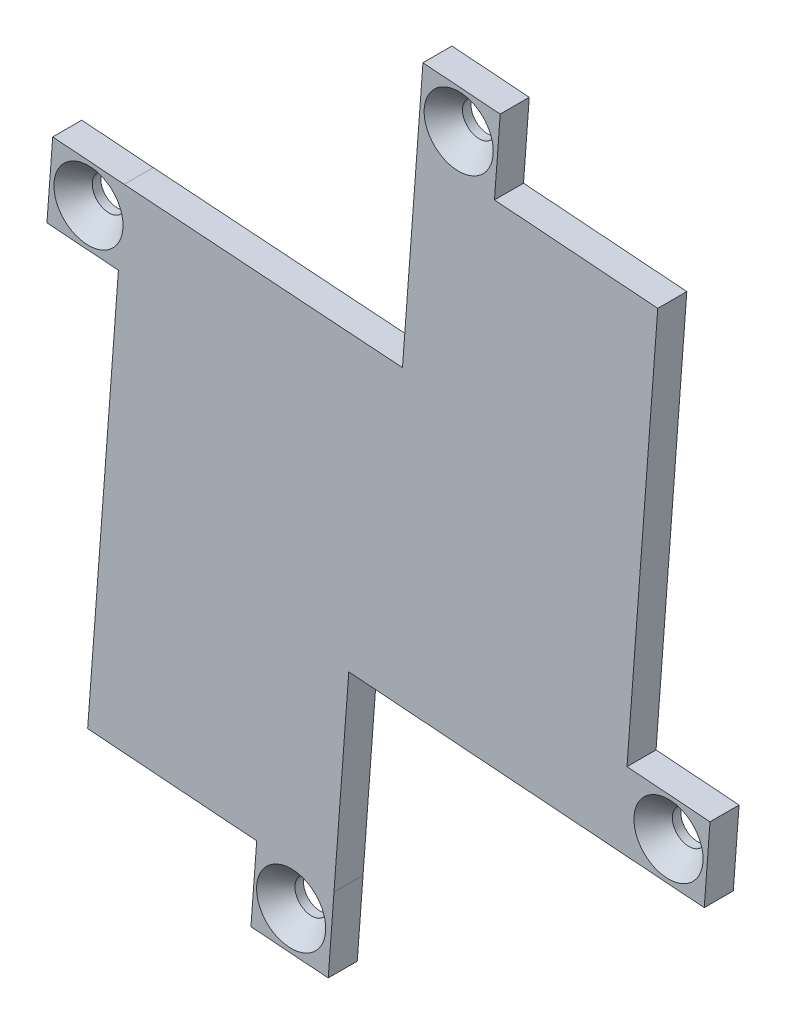
ISO-10303-21;
HEADER;
FILE_DESCRIPTION(('STEP AP214'),'2;1');
FILE_NAME('part.step','',(''),(''),'','','');
FILE_SCHEMA(('AUTOMOTIVE_DESIGN { 1 0 10303 214 1 1 1 1 }'));
ENDSEC;
DATA;
#1=APPLICATION_CONTEXT('core data for automotive mechanical design processes');
#2=APPLICATION_PROTOCOL_DEFINITION('international standard','automotive_design',2000,#1);
#3=PRODUCT_CONTEXT('',#1,'mechanical');
#4=PRODUCT('Part','Part','',(#3));
#5=PRODUCT_RELATED_PRODUCT_CATEGORY('part','',(#4));
#6=PRODUCT_DEFINITION_FORMATION('','',#4);
#7=PRODUCT_DEFINITION_CONTEXT('part definition',#1,'design');
#8=PRODUCT_DEFINITION('design','',#6,#7);
#9=PRODUCT_DEFINITION_SHAPE('','',#8);
#10=(LENGTH_UNIT() NAMED_UNIT(*) SI_UNIT(.MILLI.,.METRE.));
#11=(NAMED_UNIT(*) PLANE_ANGLE_UNIT() SI_UNIT($,.RADIAN.));
#12=(NAMED_UNIT(*) SI_UNIT($,.STERADIAN.) SOLID_ANGLE_UNIT());
#13=UNCERTAINTY_MEASURE_WITH_UNIT(LENGTH_MEASURE(1.E-05),#10,'distance_accuracy_value','');
#14=(GEOMETRIC_REPRESENTATION_CONTEXT(3) GLOBAL_UNCERTAINTY_ASSIGNED_CONTEXT((#13)) GLOBAL_UNIT_ASSIGNED_CONTEXT((#10,
#11,#12)) REPRESENTATION_CONTEXT('',''));
#15=CARTESIAN_POINT('',(0.,0.,0.));
#16=DIRECTION('',(0.,0.,1.));
#17=DIRECTION('',(1.,0.,0.));
#18=AXIS2_PLACEMENT_3D('',#15,#16,#17);
#19=CARTESIAN_POINT('',(-1.11849366012123,-14.9906316009668,3.));
#20=DIRECTION('',(-0.0744060196512933,-0.997228030211572,0.));
#21=DIRECTION('',(0.997228030211572,-0.0744060196512933,0.));
#22=AXIS2_PLACEMENT_3D('',#19,#20,#21);
#23=PLANE('',#22);
#24=DIRECTION('',(-0.997228030211572,0.0744060196512933,0.));
#25=VECTOR('',#24,1.);
#26=CARTESIAN_POINT('',(-1.11849366012123,-14.9906316009668,0.));
#27=LINE('',#26,#25);
#28=CARTESIAN_POINT('',(34.6728480546199,-17.6611254040824,0.));
#29=VERTEX_POINT('',#28);
#30=CARTESIAN_POINT('',(-2.02528865101463,-14.9229730475888,0.));
#31=VERTEX_POINT('',#30);
#32=EDGE_CURVE('E196',#29,#31,#27,.T.);
#33=ORIENTED_EDGE('',*,*,#32,.F.);
#34=DIRECTION('',(0.,0.,-1.));
#35=VECTOR('',#34,1.);
#36=CARTESIAN_POINT('',(34.6728480546199,-17.6611254040824,3.));
#37=LINE('',#36,#35);
#38=CARTESIAN_POINT('',(34.6728480546199,-17.6611254040824,3.));
#39=VERTEX_POINT('',#38);
#40=EDGE_CURVE('E11',#39,#29,#37,.T.);
#41=ORIENTED_EDGE('',*,*,#40,.F.);
#42=DIRECTION('',(-0.997228030211572,0.0744060196512933,0.));
#43=VECTOR('',#42,1.);
#44=CARTESIAN_POINT('',(-1.11849366012123,-14.9906316009668,3.));
#45=LINE('',#44,#43);
#46=CARTESIAN_POINT('',(-2.02528865101463,-14.9229730475888,3.));
#47=VERTEX_POINT('',#46);
#48=EDGE_CURVE('E238',#39,#47,#45,.T.);
#49=ORIENTED_EDGE('',*,*,#48,.T.);
#50=DIRECTION('',(0.,0.,-1.));
#51=VECTOR('',#50,1.);
#52=CARTESIAN_POINT('',(-2.02528865101463,-14.9229730475888,3.));
#53=LINE('',#52,#51);
#54=EDGE_CURVE('E121',#47,#31,#53,.T.);
#55=ORIENTED_EDGE('',*,*,#54,.T.);
#56=EDGE_LOOP('',(#33,#41,#49,#55));
#57=FACE_BOUND('',#56,.T.);
#58=ADVANCED_FACE('F37',(#57),#23,.T.);
#59=CARTESIAN_POINT('',(35.7913669216806,-2.67056932096597,3.));
#60=DIRECTION('',(-0.997227877974212,0.074408059987134,0.));
#61=DIRECTION('',(-0.074408059987134,-0.997227877974213,0.));
#62=AXIS2_PLACEMENT_3D('',#59,#60,#61);
#63=PLANE('',#62);
#64=DIRECTION('',(0.074408059987134,0.997227877974213,0.));
#65=VECTOR('',#64,1.);
#66=CARTESIAN_POINT('',(35.7913669216806,-2.67056932096597,0.));
#67=LINE('',#66,#65);
#68=CARTESIAN_POINT('',(35.268112443172,-9.6833036045072,0.));
#69=VERTEX_POINT('',#68);
#70=EDGE_CURVE('E199',#29,#69,#67,.T.);
#71=ORIENTED_EDGE('',*,*,#70,.T.);
#72=DIRECTION('',(0.,0.,-1.));
#73=VECTOR('',#72,1.);
#74=CARTESIAN_POINT('',(35.268112443172,-9.6833036045072,3.));
#75=LINE('',#74,#73);
#76=CARTESIAN_POINT('',(35.268112443172,-9.6833036045072,3.));
#77=VERTEX_POINT('',#76);
#78=EDGE_CURVE('E45',#77,#69,#75,.T.);
#79=ORIENTED_EDGE('',*,*,#78,.F.);
#80=DIRECTION('',(0.074408059987134,0.997227877974213,0.));
#81=VECTOR('',#80,1.);
#82=CARTESIAN_POINT('',(35.7913669216806,-2.67056932096597,3.));
#83=LINE('',#82,#81);
#84=EDGE_CURVE('E338',#39,#77,#83,.T.);
#85=ORIENTED_EDGE('',*,*,#84,.F.);
#86=ORIENTED_EDGE('',*,*,#40,.T.);
#87=EDGE_LOOP('',(#71,#79,#85,#86));
#88=FACE_BOUND('',#87,.T.);
#89=ADVANCED_FACE('F343',(#88),#63,.F.);
#90=CARTESIAN_POINT('',(-0.523254478508531,-7.01273428354124,3.));
#91=DIRECTION('',(-0.0744080599871337,-0.997227877974212,0.));
#92=DIRECTION('',(0.997227877974213,-0.0744080599871337,0.));
#93=AXIS2_PLACEMENT_3D('',#90,#91,#92);
#94=PLANE('',#93);
#95=DIRECTION('',(-0.997227877974213,0.0744080599871337,0.));
#96=VECTOR('',#95,1.);
#97=CARTESIAN_POINT('',(-0.523254478508531,-7.01273428354124,0.));
#98=LINE('',#97,#96);
#99=CARTESIAN_POINT('',(26.6973524890665,-9.04379719390032,0.));
#100=VERTEX_POINT('',#99);
#101=EDGE_CURVE('E202',#69,#100,#98,.T.);
#102=ORIENTED_EDGE('',*,*,#101,.T.);
#103=DIRECTION('',(0.,0.,-1.));
#104=VECTOR('',#103,1.);
#105=CARTESIAN_POINT('',(26.6973524890665,-9.04379719390032,3.));
#106=LINE('',#105,#104);
#107=CARTESIAN_POINT('',(26.6973524890665,-9.04379719390032,3.));
#108=VERTEX_POINT('',#107);
#109=EDGE_CURVE('E272',#108,#100,#106,.T.);
#110=ORIENTED_EDGE('',*,*,#109,.F.);
#111=DIRECTION('',(-0.997227877974213,0.0744080599871337,0.));
#112=VECTOR('',#111,1.);
#113=CARTESIAN_POINT('',(-0.523254478508531,-7.01273428354124,3.));
#114=LINE('',#113,#112);
#115=EDGE_CURVE('E281',#77,#108,#114,.T.);
#116=ORIENTED_EDGE('',*,*,#115,.F.);
#117=ORIENTED_EDGE('',*,*,#78,.T.);
#118=EDGE_LOOP('',(#102,#110,#116,#117));
#119=FACE_BOUND('',#118,.T.);
#120=ADVANCED_FACE('F279',(#119),#94,.F.);
#121=CARTESIAN_POINT('',(27.2206069675751,-2.03106291035925,3.));
#122=DIRECTION('',(-0.997227877974212,0.0744080599871397,0.));
#123=DIRECTION('',(-0.0744080599871397,-0.997227877974212,0.));
#124=AXIS2_PLACEMENT_3D('',#121,#122,#123);
#125=PLANE('',#124);
#126=DIRECTION('',(0.0744080599871397,0.997227877974212,0.));
#127=VECTOR('',#126,1.);
#128=CARTESIAN_POINT('',(27.2206069675751,-2.03106291035925,0.));
#129=LINE('',#128,#127);
#130=CARTESIAN_POINT('',(29.8736465497676,33.525367847124,0.));
#131=VERTEX_POINT('',#130);
#132=EDGE_CURVE('E204',#100,#131,#129,.T.);
#133=ORIENTED_EDGE('',*,*,#132,.T.);
#134=DIRECTION('',(0.,0.,-1.));
#135=VECTOR('',#134,1.);
#136=CARTESIAN_POINT('',(29.8736465497676,33.525367847124,3.));
#137=LINE('',#136,#135);
#138=CARTESIAN_POINT('',(29.8736465497676,33.525367847124,3.));
#139=VERTEX_POINT('',#138);
#140=EDGE_CURVE('E269',#139,#131,#137,.T.);
#141=ORIENTED_EDGE('',*,*,#140,.F.);
#142=DIRECTION('',(0.0744080599871397,0.997227877974212,0.));
#143=VECTOR('',#142,1.);
#144=CARTESIAN_POINT('',(27.2206069675751,-2.03106291035925,3.));
#145=LINE('',#144,#143);
#146=EDGE_CURVE('E300',#108,#139,#145,.T.);
#147=ORIENTED_EDGE('',*,*,#146,.F.);
#148=ORIENTED_EDGE('',*,*,#109,.T.);
#149=EDGE_LOOP('',(#133,#141,#147,#148));
#150=FACE_BOUND('',#149,.T.);
#151=ADVANCED_FACE('F291',(#150),#125,.F.);
#152=CARTESIAN_POINT('',(2.65303958219247,35.5564307574832,3.));
#153=DIRECTION('',(-0.0744080599871398,-0.997227877974212,0.));
#154=DIRECTION('',(0.997227877974212,-0.0744080599871398,0.));
#155=AXIS2_PLACEMENT_3D('',#152,#153,#154);
#156=PLANE('',#155);
#157=DIRECTION('',(-0.997227877974212,0.0744080599871398,0.));
#158=VECTOR('',#157,1.);
#159=CARTESIAN_POINT('',(2.65303958219247,35.5564307574832,0.));
#160=LINE('',#159,#158);
#161=CARTESIAN_POINT('',(13.0149922740122,34.7832746770063,0.));
#162=VERTEX_POINT('',#161);
#163=EDGE_CURVE('E206',#131,#162,#160,.T.);
#164=ORIENTED_EDGE('',*,*,#163,.T.);
#165=DIRECTION('',(0.,0.,-1.));
#166=VECTOR('',#165,1.);
#167=CARTESIAN_POINT('',(13.0149922740122,34.7832746770063,3.));
#168=LINE('',#167,#166);
#169=CARTESIAN_POINT('',(13.0149922740122,34.7832746770063,3.));
#170=VERTEX_POINT('',#169);
#171=EDGE_CURVE('E266',#170,#162,#168,.T.);
#172=ORIENTED_EDGE('',*,*,#171,.F.);
#173=DIRECTION('',(-0.997227877974212,0.0744080599871398,0.));
#174=VECTOR('',#173,1.);
#175=CARTESIAN_POINT('',(2.65303958219247,35.5564307574832,3.));
#176=LINE('',#175,#174);
#177=EDGE_CURVE('E297',#139,#170,#176,.T.);
#178=ORIENTED_EDGE('',*,*,#177,.F.);
#179=ORIENTED_EDGE('',*,*,#140,.T.);
#180=EDGE_LOOP('',(#164,#172,#178,#179));
#181=FACE_BOUND('',#180,.T.);
#182=ADVANCED_FACE('F295',(#181),#156,.F.);
#183=CARTESIAN_POINT('',(10.3619526918197,-0.773156080476891,3.));
#184=DIRECTION('',(-0.997227877974212,0.0744080599871399,0.));
#185=DIRECTION('',(-0.0744080599871399,-0.997227877974212,0.));
#186=AXIS2_PLACEMENT_3D('',#183,#184,#185);
#187=PLANE('',#186);
#188=DIRECTION('',(0.0744080599871399,0.997227877974212,0.));
#189=VECTOR('',#188,1.);
#190=CARTESIAN_POINT('',(10.3619526918197,-0.773156080476891,0.));
#191=LINE('',#190,#189);
#192=CARTESIAN_POINT('',(13.6102567539093,42.7610977008,0.));
#193=VERTEX_POINT('',#192);
#194=EDGE_CURVE('E208',#162,#193,#191,.T.);
#195=ORIENTED_EDGE('',*,*,#194,.T.);
#196=DIRECTION('',(0.,0.,-1.));
#197=VECTOR('',#196,1.);
#198=CARTESIAN_POINT('',(13.6102567539093,42.7610977008,3.));
#199=LINE('',#198,#197);
#200=CARTESIAN_POINT('',(13.6102567539093,42.7610977008,3.));
#201=VERTEX_POINT('',#200);
#202=EDGE_CURVE('E263',#201,#193,#199,.T.);
#203=ORIENTED_EDGE('',*,*,#202,.F.);
#204=DIRECTION('',(0.0744080599871399,0.997227877974212,0.));
#205=VECTOR('',#204,1.);
#206=CARTESIAN_POINT('',(10.3619526918197,-0.773156080476891,3.));
#207=LINE('',#206,#205);
#208=EDGE_CURVE('E299',#170,#201,#207,.T.);
#209=ORIENTED_EDGE('',*,*,#208,.F.);
#210=ORIENTED_EDGE('',*,*,#171,.T.);
#211=EDGE_LOOP('',(#195,#203,#209,#210));
#212=FACE_BOUND('',#211,.T.);
#213=ADVANCED_FACE('F355',(#212),#187,.F.);
#214=CARTESIAN_POINT('',(3.2483040620896,43.5342537812769,3.));
#215=DIRECTION('',(-0.07440805998714,-0.997227877974212,0.));
#216=DIRECTION('',(0.997227877974212,-0.07440805998714,0.));
#217=AXIS2_PLACEMENT_3D('',#214,#215,#216);
#218=PLANE('',#217);
#219=DIRECTION('',(-0.997227877974212,0.07440805998714,0.));
#220=VECTOR('',#219,1.);
#221=CARTESIAN_POINT('',(3.2483040620896,43.5342537812769,0.));
#222=LINE('',#221,#220);
#223=CARTESIAN_POINT('',(5.63243373011565,43.3563621806971,0.));
#224=VERTEX_POINT('',#223);
#225=EDGE_CURVE('E210',#193,#224,#222,.T.);
#226=ORIENTED_EDGE('',*,*,#225,.T.);
#227=DIRECTION('',(0.,0.,-1.));
#228=VECTOR('',#227,1.);
#229=CARTESIAN_POINT('',(5.63243373011565,43.3563621806971,3.));
#230=LINE('',#229,#228);
#231=CARTESIAN_POINT('',(5.63243373011565,43.3563621806971,3.));
#232=VERTEX_POINT('',#231);
#233=EDGE_CURVE('E261',#232,#224,#230,.T.);
#234=ORIENTED_EDGE('',*,*,#233,.F.);
#235=DIRECTION('',(-0.997227877974212,0.07440805998714,0.));
#236=VECTOR('',#235,1.);
#237=CARTESIAN_POINT('',(3.2483040620896,43.5342537812769,3.));
#238=LINE('',#237,#236);
#239=EDGE_CURVE('E302',#201,#232,#238,.T.);
#240=ORIENTED_EDGE('',*,*,#239,.F.);
#241=ORIENTED_EDGE('',*,*,#202,.T.);
#242=EDGE_LOOP('',(#226,#234,#240,#241));
#243=FACE_BOUND('',#242,.T.);
#244=ADVANCED_FACE('F358',(#243),#218,.F.);
#245=CARTESIAN_POINT('',(2.38412805057406,-0.177891588407963,3.));
#246=DIRECTION('',(0.997227874606259,-0.0744081051249282,0.));
#247=DIRECTION('',(0.0744081051249282,0.99722787460626,0.));
#248=AXIS2_PLACEMENT_3D('',#245,#246,#247);
#249=PLANE('',#248);
#250=DIRECTION('',(-0.0744081051249282,-0.99722787460626,0.));
#251=VECTOR('',#250,1.);
#252=CARTESIAN_POINT('',(2.38412805057406,-0.177891588407963,0.));
#253=LINE('',#252,#251);
#254=CARTESIAN_POINT('',(5.03716925021859,35.3785391569034,0.));
#255=VERTEX_POINT('',#254);
#256=CARTESIAN_POINT('',(3.51996827997691,15.0447986811259,0.));
#257=VERTEX_POINT('',#256);
#258=EDGE_CURVE('E216',#255,#257,#253,.T.);
#259=ORIENTED_EDGE('',*,*,#258,.T.);
#260=DIRECTION('',(0.,0.,-1.));
#261=VECTOR('',#260,1.);
#262=CARTESIAN_POINT('',(3.51996827997691,15.0447986811259,3.));
#263=LINE('',#262,#261);
#264=CARTESIAN_POINT('',(3.51996827997691,15.0447986811259,3.));
#265=VERTEX_POINT('',#264);
#266=EDGE_CURVE('E258',#265,#257,#263,.T.);
#267=ORIENTED_EDGE('',*,*,#266,.F.);
#268=DIRECTION('',(-0.0744081051249282,-0.99722787460626,0.));
#269=VECTOR('',#268,1.);
#270=CARTESIAN_POINT('',(2.38412805057406,-0.177891588407963,3.));
#271=LINE('',#270,#269);
#272=CARTESIAN_POINT('',(5.03716925021859,35.3785391569034,3.));
#273=VERTEX_POINT('',#272);
#274=EDGE_CURVE('E311',#273,#265,#271,.T.);
#275=ORIENTED_EDGE('',*,*,#274,.F.);
#276=DIRECTION('',(0.0744080599871316,0.997227877974213,0.));
#277=VECTOR('',#276,1.);
#278=CARTESIAN_POINT('',(2.38412966802641,-0.177891600579779,3.));
#279=LINE('',#278,#277);
#280=EDGE_CURVE('E308',#273,#232,#279,.T.);
#281=ORIENTED_EDGE('',*,*,#280,.T.);
#282=ORIENTED_EDGE('',*,*,#233,.T.);
#283=DIRECTION('',(0.0744080599871316,0.997227877974213,0.));
#284=VECTOR('',#283,1.);
#285=CARTESIAN_POINT('',(2.38412966802641,-0.177891600579779,0.));
#286=LINE('',#285,#284);
#287=EDGE_CURVE('E213',#255,#224,#286,.T.);
#288=ORIENTED_EDGE('',*,*,#287,.F.);
#289=EDGE_LOOP('',(#259,#267,#275,#281,#282,#288));
#290=FACE_BOUND('',#289,.T.);
#291=ADVANCED_FACE('F362',(#290),#249,.F.);
#292=CARTESIAN_POINT('',(1.07049910682802,15.2171148259438,3.));
#293=DIRECTION('',(-0.0701749325156104,-0.997534700572581,0.));
#294=DIRECTION('',(0.997534700572581,-0.0701749325156104,0.));
#295=AXIS2_PLACEMENT_3D('',#292,#293,#294);
#296=PLANE('',#295);
#297=DIRECTION('',(-0.997534700572581,0.0701749325156104,0.));
#298=VECTOR('',#297,1.);
#299=CARTESIAN_POINT('',(1.07049910682802,15.2171148259438,0.));
#300=LINE('',#299,#298);
#301=CARTESIAN_POINT('',(-25.2093922571763,17.0658621446366,0.));
#302=VERTEX_POINT('',#301);
#303=EDGE_CURVE('E218',#257,#302,#300,.T.);
#304=ORIENTED_EDGE('',*,*,#303,.T.);
#305=DIRECTION('',(0.,0.,-1.));
#306=VECTOR('',#305,1.);
#307=CARTESIAN_POINT('',(-25.2093922571763,17.0658621446366,3.));
#308=LINE('',#307,#306);
#309=CARTESIAN_POINT('',(-25.2093922571763,17.0658621446366,3.));
#310=VERTEX_POINT('',#309);
#311=EDGE_CURVE('E256',#310,#302,#308,.T.);
#312=ORIENTED_EDGE('',*,*,#311,.F.);
#313=DIRECTION('',(-0.997534700572581,0.0701749325156104,0.));
#314=VECTOR('',#313,1.);
#315=CARTESIAN_POINT('',(1.07049910682802,15.2171148259438,3.));
#316=LINE('',#315,#314);
#317=EDGE_CURVE('E313',#265,#310,#316,.T.);
#318=ORIENTED_EDGE('',*,*,#317,.F.);
#319=ORIENTED_EDGE('',*,*,#266,.T.);
#320=EDGE_LOOP('',(#304,#312,#318,#319));
#321=FACE_BOUND('',#320,.T.);
#322=ADVANCED_FACE('F366',(#321),#296,.F.);
#323=CARTESIAN_POINT('',(1.12674425170494,15.1007939105204,3.));
#324=DIRECTION('',(0.0744080599871348,0.997227877974213,0.));
#325=DIRECTION('',(-0.997227877974213,0.0744080599871348,0.));
#326=AXIS2_PLACEMENT_3D('',#323,#324,#325);
#327=PLANE('',#326);
#328=DIRECTION('',(0.997227877974213,-0.0744080599871349,0.));
#329=VECTOR('',#328,1.);
#330=CARTESIAN_POINT('',(1.12674425170494,15.1007939105204,0.));
#331=LINE('',#330,#329);
#332=CARTESIAN_POINT('',(-32.5897658444486,17.6165479936171,0.));
#333=VERTEX_POINT('',#332);
#334=EDGE_CURVE('E221',#333,#302,#331,.T.);
#335=ORIENTED_EDGE('',*,*,#334,.F.);
#336=DIRECTION('',(0.,0.,-1.));
#337=VECTOR('',#336,1.);
#338=CARTESIAN_POINT('',(-32.5897658444486,17.6165479936171,3.));
#339=LINE('',#338,#337);
#340=CARTESIAN_POINT('',(-32.5897658444486,17.6165479936171,3.));
#341=VERTEX_POINT('',#340);
#342=EDGE_CURVE('E254',#341,#333,#339,.T.);
#343=ORIENTED_EDGE('',*,*,#342,.F.);
#344=DIRECTION('',(0.997227877974213,-0.0744080599871349,0.));
#345=VECTOR('',#344,1.);
#346=CARTESIAN_POINT('',(1.12674425170494,15.1007939105204,3.));
#347=LINE('',#346,#345);
#348=EDGE_CURVE('E315',#341,#310,#347,.T.);
#349=ORIENTED_EDGE('',*,*,#348,.T.);
#350=ORIENTED_EDGE('',*,*,#311,.T.);
#351=EDGE_LOOP('',(#335,#343,#349,#350));
#352=FACE_BOUND('',#351,.T.);
#353=ADVANCED_FACE('F370',(#352),#327,.T.);
#354=CARTESIAN_POINT('',(-33.7164843469224,2.51568279359108,3.));
#355=DIRECTION('',(0.997228030211571,-0.0744060196513036,0.));
#356=DIRECTION('',(0.0744060196513036,0.997228030211571,0.));
#357=AXIS2_PLACEMENT_3D('',#354,#355,#356);
#358=PLANE('',#357);
#359=DIRECTION('',(-0.0744060196513036,-0.997228030211571,0.));
#360=VECTOR('',#359,1.);
#361=CARTESIAN_POINT('',(-33.7164843469224,2.51568279359108,0.));
#362=LINE('',#361,#360);
#363=CARTESIAN_POINT('',(-33.1850139767339,9.63872408598436,0.));
#364=VERTEX_POINT('',#363);
#365=EDGE_CURVE('E224',#333,#364,#362,.T.);
#366=ORIENTED_EDGE('',*,*,#365,.T.);
#367=DIRECTION('',(0.,0.,-1.));
#368=VECTOR('',#367,1.);
#369=CARTESIAN_POINT('',(-33.1850139767339,9.63872408598436,3.));
#370=LINE('',#369,#368);
#371=CARTESIAN_POINT('',(-33.1850139767339,9.63872408598436,3.));
#372=VERTEX_POINT('',#371);
#373=EDGE_CURVE('E251',#372,#364,#370,.T.);
#374=ORIENTED_EDGE('',*,*,#373,.F.);
#375=DIRECTION('',(-0.0744060196513036,-0.997228030211571,0.));
#376=VECTOR('',#375,1.);
#377=CARTESIAN_POINT('',(-33.7164843469224,2.51568279359108,3.));
#378=LINE('',#377,#376);
#379=EDGE_CURVE('E318',#341,#372,#378,.T.);
#380=ORIENTED_EDGE('',*,*,#379,.F.);
#381=ORIENTED_EDGE('',*,*,#342,.T.);
#382=EDGE_LOOP('',(#366,#374,#380,#381));
#383=FACE_BOUND('',#382,.T.);
#384=ADVANCED_FACE('F374',(#383),#358,.F.);
#385=CARTESIAN_POINT('',(0.531480005272647,7.12296967062796,3.));
#386=DIRECTION('',(0.0744081051249289,0.997227874606259,0.));
#387=DIRECTION('',(-0.99722787460626,0.0744081051249289,0.));
#388=AXIS2_PLACEMENT_3D('',#385,#386,#387);
#389=PLANE('',#388);
#390=DIRECTION('',(0.99722787460626,-0.0744081051249289,0.));
#391=VECTOR('',#390,1.);
#392=CARTESIAN_POINT('',(0.531480005272647,7.12296967062796,0.));
#393=LINE('',#392,#391);
#394=CARTESIAN_POINT('',(-25.8046404143867,9.088037902944,0.));
#395=VERTEX_POINT('',#394);
#396=EDGE_CURVE('E226',#364,#395,#393,.T.);
#397=ORIENTED_EDGE('',*,*,#396,.T.);
#398=DIRECTION('',(0.,0.,-1.));
#399=VECTOR('',#398,1.);
#400=CARTESIAN_POINT('',(-25.8046404143867,9.088037902944,3.));
#401=LINE('',#400,#399);
#402=CARTESIAN_POINT('',(-25.8046404143867,9.088037902944,3.));
#403=VERTEX_POINT('',#402);
#404=EDGE_CURVE('E248',#403,#395,#401,.T.);
#405=ORIENTED_EDGE('',*,*,#404,.F.);
#406=DIRECTION('',(0.99722787460626,-0.0744081051249289,0.));
#407=VECTOR('',#406,1.);
#408=CARTESIAN_POINT('',(0.531480005272647,7.12296967062796,3.));
#409=LINE('',#408,#407);
#410=EDGE_CURVE('E320',#372,#403,#409,.T.);
#411=ORIENTED_EDGE('',*,*,#410,.F.);
#412=ORIENTED_EDGE('',*,*,#373,.T.);
#413=EDGE_LOOP('',(#397,#405,#411,#412));
#414=FACE_BOUND('',#413,.T.);
#415=ADVANCED_FACE('F378',(#414),#389,.F.);
#416=CARTESIAN_POINT('',(-26.3361201861958,1.96506701620058,3.));
#417=DIRECTION('',(0.997227877974212,-0.0744080599871336,0.));
#418=DIRECTION('',(0.0744080599871336,0.997227877974213,0.));
#419=AXIS2_PLACEMENT_3D('',#416,#417,#418);
#420=PLANE('',#419);
#421=DIRECTION('',(-0.0744080599871336,-0.997227877974213,0.));
#422=VECTOR('',#421,1.);
#423=CARTESIAN_POINT('',(-26.3361201861958,1.96506701620058,0.));
#424=LINE('',#423,#422);
#425=CARTESIAN_POINT('',(-28.9809344750875,-33.4811271380803,0.));
#426=VERTEX_POINT('',#425);
#427=EDGE_CURVE('E228',#395,#426,#424,.T.);
#428=ORIENTED_EDGE('',*,*,#427,.T.);
#429=DIRECTION('',(0.,0.,-1.));
#430=VECTOR('',#429,1.);
#431=CARTESIAN_POINT('',(-28.9809344750875,-33.4811271380803,3.));
#432=LINE('',#431,#430);
#433=CARTESIAN_POINT('',(-28.9809344750875,-33.4811271380803,3.));
#434=VERTEX_POINT('',#433);
#435=EDGE_CURVE('E245',#434,#426,#432,.T.);
#436=ORIENTED_EDGE('',*,*,#435,.F.);
#437=DIRECTION('',(-0.0744080599871336,-0.997227877974213,0.));
#438=VECTOR('',#437,1.);
#439=CARTESIAN_POINT('',(-26.3361201861958,1.96506701620058,3.));
#440=LINE('',#439,#438);
#441=EDGE_CURVE('E322',#403,#434,#440,.T.);
#442=ORIENTED_EDGE('',*,*,#441,.F.);
#443=ORIENTED_EDGE('',*,*,#404,.T.);
#444=EDGE_LOOP('',(#428,#436,#442,#443));
#445=FACE_BOUND('',#444,.T.);
#446=ADVANCED_FACE('F382',(#445),#420,.F.);
#447=CARTESIAN_POINT('',(-2.6448142888917,-35.4461941542809,3.));
#448=DIRECTION('',(0.0744080599871344,0.997227877974212,0.));
#449=DIRECTION('',(-0.997227877974213,0.0744080599871344,0.));
#450=AXIS2_PLACEMENT_3D('',#447,#448,#449);
#451=PLANE('',#450);
#452=DIRECTION('',(0.997227877974213,-0.0744080599871344,0.));
#453=VECTOR('',#452,1.);
#454=CARTESIAN_POINT('',(-2.6448142888917,-35.4461941542809,0.));
#455=LINE('',#454,#453);
#456=CARTESIAN_POINT('',(-11.5293596419709,-34.7832746770063,0.));
#457=VERTEX_POINT('',#456);
#458=EDGE_CURVE('E230',#426,#457,#455,.T.);
#459=ORIENTED_EDGE('',*,*,#458,.T.);
#460=DIRECTION('',(0.,0.,-1.));
#461=VECTOR('',#460,1.);
#462=CARTESIAN_POINT('',(-11.5293596419709,-34.7832746770063,3.));
#463=LINE('',#462,#461);
#464=CARTESIAN_POINT('',(-11.5293596419709,-34.7832746770063,3.));
#465=VERTEX_POINT('',#464);
#466=EDGE_CURVE('E242',#465,#457,#463,.T.);
#467=ORIENTED_EDGE('',*,*,#466,.F.);
#468=DIRECTION('',(0.997227877974213,-0.0744080599871344,0.));
#469=VECTOR('',#468,1.);
#470=CARTESIAN_POINT('',(-2.6448142888917,-35.4461941542809,3.));
#471=LINE('',#470,#469);
#472=EDGE_CURVE('E324',#434,#465,#471,.T.);
#473=ORIENTED_EDGE('',*,*,#472,.F.);
#474=ORIENTED_EDGE('',*,*,#435,.T.);
#475=EDGE_LOOP('',(#459,#467,#473,#474));
#476=FACE_BOUND('',#475,.T.);
#477=ADVANCED_FACE('F330',(#476),#451,.F.);
#478=CARTESIAN_POINT('',(-8.88454535307926,0.662919477274607,3.));
#479=DIRECTION('',(0.997227877974212,-0.0744080599871336,0.));
#480=DIRECTION('',(0.0744080599871336,0.997227877974213,0.));
#481=AXIS2_PLACEMENT_3D('',#478,#479,#480);
#482=PLANE('',#481);
#483=DIRECTION('',(-0.0744080599871336,-0.997227877974213,0.));
#484=VECTOR('',#483,1.);
#485=CARTESIAN_POINT('',(-8.88454535307926,0.662919477274607,0.));
#486=LINE('',#485,#484);
#487=CARTESIAN_POINT('',(-12.124624121868,-42.7610977008,0.));
#488=VERTEX_POINT('',#487);
#489=EDGE_CURVE('E232',#457,#488,#486,.T.);
#490=ORIENTED_EDGE('',*,*,#489,.T.);
#491=DIRECTION('',(0.,0.,-1.));
#492=VECTOR('',#491,1.);
#493=CARTESIAN_POINT('',(-12.124624121868,-42.7610977008,3.));
#494=LINE('',#493,#492);
#495=CARTESIAN_POINT('',(-12.124624121868,-42.7610977008,3.));
#496=VERTEX_POINT('',#495);
#497=EDGE_CURVE('E188',#496,#488,#494,.T.);
#498=ORIENTED_EDGE('',*,*,#497,.F.);
#499=DIRECTION('',(-0.0744080599871336,-0.997227877974213,0.));
#500=VECTOR('',#499,1.);
#501=CARTESIAN_POINT('',(-8.88454535307926,0.662919477274607,3.));
#502=LINE('',#501,#500);
#503=EDGE_CURVE('E179',#465,#496,#502,.T.);
#504=ORIENTED_EDGE('',*,*,#503,.F.);
#505=ORIENTED_EDGE('',*,*,#466,.T.);
#506=EDGE_LOOP('',(#490,#498,#504,#505));
#507=FACE_BOUND('',#506,.T.);
#508=ADVANCED_FACE('F334',(#507),#482,.F.);
#509=CARTESIAN_POINT('',(-3.24007876878876,-43.4240171780746,3.));
#510=DIRECTION('',(0.0744080599871341,0.997227877974212,0.));
#511=DIRECTION('',(-0.997227877974213,0.0744080599871341,0.));
#512=AXIS2_PLACEMENT_3D('',#509,#510,#511);
#513=PLANE('',#512);
#514=DIRECTION('',(0.997227877974213,-0.0744080599871341,0.));
#515=VECTOR('',#514,1.);
#516=CARTESIAN_POINT('',(-3.24007876878876,-43.4240171780746,0.));
#517=LINE('',#516,#515);
#518=CARTESIAN_POINT('',(-4.14680109807431,-43.356362180697,0.));
#519=VERTEX_POINT('',#518);
#520=EDGE_CURVE('E187',#488,#519,#517,.T.);
#521=ORIENTED_EDGE('',*,*,#520,.T.);
#522=DIRECTION('',(0.,0.,-1.));
#523=VECTOR('',#522,1.);
#524=CARTESIAN_POINT('',(-4.14680109807431,-43.356362180697,3.));
#525=LINE('',#524,#523);
#526=CARTESIAN_POINT('',(-4.14680109807431,-43.356362180697,3.));
#527=VERTEX_POINT('',#526);
#528=EDGE_CURVE('E184',#527,#519,#525,.T.);
#529=ORIENTED_EDGE('',*,*,#528,.F.);
#530=DIRECTION('',(0.997227877974213,-0.0744080599871341,0.));
#531=VECTOR('',#530,1.);
#532=CARTESIAN_POINT('',(-3.24007876878876,-43.4240171780746,3.));
#533=LINE('',#532,#531);
#534=EDGE_CURVE('E173',#496,#527,#533,.T.);
#535=ORIENTED_EDGE('',*,*,#534,.F.);
#536=ORIENTED_EDGE('',*,*,#497,.T.);
#537=EDGE_LOOP('',(#521,#529,#535,#536));
#538=FACE_BOUND('',#537,.T.);
#539=ADVANCED_FACE('F185',(#538),#513,.F.);
#540=CARTESIAN_POINT('',(-0.906722329285555,0.0676549973775384,3.));
#541=DIRECTION('',(-0.997227877974212,0.0744080599871341,0.));
#542=DIRECTION('',(-0.0744080599871341,-0.997227877974213,0.));
#543=AXIS2_PLACEMENT_3D('',#540,#541,#542);
#544=PLANE('',#543);
#545=DIRECTION('',(0.0744080599871341,0.997227877974213,0.));
#546=VECTOR('',#545,1.);
#547=CARTESIAN_POINT('',(-0.906722329285555,0.0676549973775384,0.));
#548=LINE('',#547,#546);
#549=CARTESIAN_POINT('',(-3.55153661817724,-35.3785391569033,0.));
#550=VERTEX_POINT('',#549);
#551=EDGE_CURVE('E114',#519,#550,#548,.T.);
#552=ORIENTED_EDGE('',*,*,#551,.T.);
#553=DIRECTION('',(0.,0.,-1.));
#554=VECTOR('',#553,1.);
#555=CARTESIAN_POINT('',(-3.55153661817724,-35.3785391569033,3.));
#556=LINE('',#555,#554);
#557=CARTESIAN_POINT('',(-3.55153661817724,-35.3785391569033,3.));
#558=VERTEX_POINT('',#557);
#559=EDGE_CURVE('E189',#558,#550,#556,.T.);
#560=ORIENTED_EDGE('',*,*,#559,.F.);
#561=DIRECTION('',(0.0744080599871341,0.997227877974213,0.));
#562=VECTOR('',#561,1.);
#563=CARTESIAN_POINT('',(-0.906722329285555,0.0676549973775384,3.));
#564=LINE('',#563,#562);
#565=EDGE_CURVE('E177',#527,#558,#564,.T.);
#566=ORIENTED_EDGE('',*,*,#565,.F.);
#567=ORIENTED_EDGE('',*,*,#528,.T.);
#568=EDGE_LOOP('',(#552,#560,#566,#567));
#569=FACE_BOUND('',#568,.T.);
#570=ADVANCED_FACE('F191',(#569),#544,.F.);
#571=CARTESIAN_POINT('',(-0.906794990893392,0.0676585533780006,3.));
#572=DIRECTION('',(-0.997228030211572,0.0744060196512933,0.));
#573=DIRECTION('',(-0.0744060196512933,-0.997228030211572,0.));
#574=AXIS2_PLACEMENT_3D('',#571,#572,#573);
#575=PLANE('',#574);
#576=DIRECTION('',(0.0744060196512933,0.997228030211572,0.));
#577=VECTOR('',#576,1.);
#578=CARTESIAN_POINT('',(-0.906794990893392,0.0676585533780006,0.));
#579=LINE('',#578,#577);
#580=EDGE_CURVE('E236',#550,#31,#579,.T.);
#581=ORIENTED_EDGE('',*,*,#580,.T.);
#582=ORIENTED_EDGE('',*,*,#54,.F.);
#583=DIRECTION('',(0.0744060196512933,0.997228030211572,0.));
#584=VECTOR('',#583,1.);
#585=CARTESIAN_POINT('',(-0.906794990893392,0.0676585533780006,3.));
#586=LINE('',#585,#584);
#587=EDGE_CURVE('E53',#558,#47,#586,.T.);
#588=ORIENTED_EDGE('',*,*,#587,.F.);
#589=ORIENTED_EDGE('',*,*,#559,.T.);
#590=EDGE_LOOP('',(#581,#582,#588,#589));
#591=FACE_BOUND('',#590,.T.);
#592=ADVANCED_FACE('F337',(#591),#575,.F.);
#593=CARTESIAN_POINT('',(0.,0.,3.));
#594=DIRECTION('',(0.,0.,1.));
#595=DIRECTION('',(1.,0.,0.));
#596=AXIS2_PLACEMENT_3D('',#593,#594,#595);
#597=PLANE('',#596);
#598=CARTESIAN_POINT('',(-7.97339527190505,-39.0597219207628,3.));
#599=DIRECTION('',(0.,0.,1.));
#600=DIRECTION('',(1.,0.,0.));
#601=AXIS2_PLACEMENT_3D('',#598,#599,#600);
#602=CIRCLE('',#601,3.5687);
#603=CARTESIAN_POINT('',(-4.40469527190504,-39.0597219207628,3.));
#604=VERTEX_POINT('',#603);
#605=EDGE_CURVE('E442',#604,#604,#602,.T.);
#606=ORIENTED_EDGE('',*,*,#605,.F.);
#607=EDGE_LOOP('',(#606));
#608=FACE_BOUND('',#607,.T.);
#609=CARTESIAN_POINT('',(-28.8984784111493,13.3300036328133,3.));
#610=DIRECTION('',(0.,0.,1.));
#611=DIRECTION('',(1.,0.,0.));
#612=AXIS2_PLACEMENT_3D('',#609,#610,#611);
#613=CIRCLE('',#612,3.5687);
#614=CARTESIAN_POINT('',(-25.3297784111493,13.3300036328133,3.));
#615=VERTEX_POINT('',#614);
#616=EDGE_CURVE('E449',#615,#615,#613,.T.);
#617=ORIENTED_EDGE('',*,*,#616,.F.);
#618=EDGE_LOOP('',(#617));
#619=FACE_BOUND('',#618,.T.);
#620=CARTESIAN_POINT('',(9.32371300206394,39.0698184288517,3.));
#621=DIRECTION('',(0.,0.,1.));
#622=DIRECTION('',(1.,0.,0.));
#623=AXIS2_PLACEMENT_3D('',#620,#621,#622);
#624=CIRCLE('',#623,3.5687);
#625=CARTESIAN_POINT('',(12.8924130020639,39.0698184288517,3.));
#626=VERTEX_POINT('',#625);
#627=EDGE_CURVE('E458',#626,#626,#624,.T.);
#628=ORIENTED_EDGE('',*,*,#627,.F.);
#629=EDGE_LOOP('',(#628));
#630=FACE_BOUND('',#629,.T.);
#631=CARTESIAN_POINT('',(30.9815681737145,-13.3745898135715,3.));
#632=DIRECTION('',(0.,0.,1.));
#633=DIRECTION('',(1.,0.,0.));
#634=AXIS2_PLACEMENT_3D('',#631,#632,#633);
#635=CIRCLE('',#634,3.5687);
#636=CARTESIAN_POINT('',(34.5502681737145,-13.3745898135715,3.));
#637=VERTEX_POINT('',#636);
#638=EDGE_CURVE('E467',#637,#637,#635,.T.);
#639=ORIENTED_EDGE('',*,*,#638,.F.);
#640=EDGE_LOOP('',(#639));
#641=FACE_BOUND('',#640,.T.);
#642=ORIENTED_EDGE('',*,*,#48,.F.);
#643=ORIENTED_EDGE('',*,*,#84,.T.);
#644=ORIENTED_EDGE('',*,*,#115,.T.);
#645=ORIENTED_EDGE('',*,*,#146,.T.);
#646=ORIENTED_EDGE('',*,*,#177,.T.);
#647=ORIENTED_EDGE('',*,*,#208,.T.);
#648=ORIENTED_EDGE('',*,*,#239,.T.);
#649=ORIENTED_EDGE('',*,*,#280,.F.);
#650=ORIENTED_EDGE('',*,*,#274,.T.);
#651=ORIENTED_EDGE('',*,*,#317,.T.);
#652=ORIENTED_EDGE('',*,*,#348,.F.);
#653=ORIENTED_EDGE('',*,*,#379,.T.);
#654=ORIENTED_EDGE('',*,*,#410,.T.);
#655=ORIENTED_EDGE('',*,*,#441,.T.);
#656=ORIENTED_EDGE('',*,*,#472,.T.);
#657=ORIENTED_EDGE('',*,*,#503,.T.);
#658=ORIENTED_EDGE('',*,*,#534,.T.);
#659=ORIENTED_EDGE('',*,*,#565,.T.);
#660=ORIENTED_EDGE('',*,*,#587,.T.);
#661=EDGE_LOOP('',(#642,#643,#644,#645,#646,#647,#648,#649,#650,#651,#652,#653,#654,#655,#656,
#657,#658,#659,#660));
#662=FACE_BOUND('',#661,.T.);
#663=ADVANCED_FACE('F175',(#608,#619,#630,#641,#662),#597,.T.);
#664=CARTESIAN_POINT('',(0.,0.,0.));
#665=DIRECTION('',(0.,0.,1.));
#666=DIRECTION('',(1.,0.,0.));
#667=AXIS2_PLACEMENT_3D('',#664,#665,#666);
#668=PLANE('',#667);
#669=CARTESIAN_POINT('',(-7.97339527190505,-39.0597219207628,0.));
#670=DIRECTION('',(0.,0.,1.));
#671=DIRECTION('',(1.,0.,0.));
#672=AXIS2_PLACEMENT_3D('',#669,#670,#671);
#673=CIRCLE('',#672,1.72719999999999);
#674=CARTESIAN_POINT('',(-6.24619527190505,-39.0597219207628,0.));
#675=VERTEX_POINT('',#674);
#676=EDGE_CURVE('E444',#675,#675,#673,.T.);
#677=ORIENTED_EDGE('',*,*,#676,.T.);
#678=EDGE_LOOP('',(#677));
#679=FACE_BOUND('',#678,.T.);
#680=CARTESIAN_POINT('',(-28.8984784111493,13.3300036328133,0.));
#681=DIRECTION('',(0.,0.,1.));
#682=DIRECTION('',(1.,0.,0.));
#683=AXIS2_PLACEMENT_3D('',#680,#681,#682);
#684=CIRCLE('',#683,1.72719999999999);
#685=CARTESIAN_POINT('',(-27.1712784111493,13.3300036328133,0.));
#686=VERTEX_POINT('',#685);
#687=EDGE_CURVE('E455',#686,#686,#684,.T.);
#688=ORIENTED_EDGE('',*,*,#687,.T.);
#689=EDGE_LOOP('',(#688));
#690=FACE_BOUND('',#689,.T.);
#691=CARTESIAN_POINT('',(9.32371300206394,39.0698184288517,0.));
#692=DIRECTION('',(0.,0.,1.));
#693=DIRECTION('',(1.,0.,0.));
#694=AXIS2_PLACEMENT_3D('',#691,#692,#693);
#695=CIRCLE('',#694,1.72719999999999);
#696=CARTESIAN_POINT('',(11.0509130020639,39.0698184288517,0.));
#697=VERTEX_POINT('',#696);
#698=EDGE_CURVE('E464',#697,#697,#695,.T.);
#699=ORIENTED_EDGE('',*,*,#698,.T.);
#700=EDGE_LOOP('',(#699));
#701=FACE_BOUND('',#700,.T.);
#702=CARTESIAN_POINT('',(30.9815681737145,-13.3745898135715,0.));
#703=DIRECTION('',(0.,0.,1.));
#704=DIRECTION('',(1.,0.,0.));
#705=AXIS2_PLACEMENT_3D('',#702,#703,#704);
#706=CIRCLE('',#705,1.72719999999999);
#707=CARTESIAN_POINT('',(32.7087681737145,-13.3745898135715,0.));
#708=VERTEX_POINT('',#707);
#709=EDGE_CURVE('E200',#708,#708,#706,.T.);
#710=ORIENTED_EDGE('',*,*,#709,.T.);
#711=EDGE_LOOP('',(#710));
#712=FACE_BOUND('',#711,.T.);
#713=ORIENTED_EDGE('',*,*,#32,.T.);
#714=ORIENTED_EDGE('',*,*,#580,.F.);
#715=ORIENTED_EDGE('',*,*,#551,.F.);
#716=ORIENTED_EDGE('',*,*,#520,.F.);
#717=ORIENTED_EDGE('',*,*,#489,.F.);
#718=ORIENTED_EDGE('',*,*,#458,.F.);
#719=ORIENTED_EDGE('',*,*,#427,.F.);
#720=ORIENTED_EDGE('',*,*,#396,.F.);
#721=ORIENTED_EDGE('',*,*,#365,.F.);
#722=ORIENTED_EDGE('',*,*,#334,.T.);
#723=ORIENTED_EDGE('',*,*,#303,.F.);
#724=ORIENTED_EDGE('',*,*,#258,.F.);
#725=ORIENTED_EDGE('',*,*,#287,.T.);
#726=ORIENTED_EDGE('',*,*,#225,.F.);
#727=ORIENTED_EDGE('',*,*,#194,.F.);
#728=ORIENTED_EDGE('',*,*,#163,.F.);
#729=ORIENTED_EDGE('',*,*,#132,.F.);
#730=ORIENTED_EDGE('',*,*,#101,.F.);
#731=ORIENTED_EDGE('',*,*,#70,.F.);
#732=EDGE_LOOP('',(#713,#714,#715,#716,#717,#718,#719,#720,#721,#722,#723,#724,#725,#726,#727,
#728,#729,#730,#731));
#733=FACE_BOUND('',#732,.T.);
#734=ADVANCED_FACE('F286',(#679,#690,#701,#712,#733),#668,.F.);
#735=CARTESIAN_POINT('',(30.9815681737145,-13.3745898135715,3.));
#736=DIRECTION('',(0.,0.,1.));
#737=DIRECTION('',(1.,0.,0.));
#738=AXIS2_PLACEMENT_3D('',#735,#736,#737);
#739=CYLINDRICAL_SURFACE('',#738,1.72719999999999);
#740=ORIENTED_EDGE('',*,*,#709,.F.);
#741=EDGE_LOOP('',(#740));
#742=FACE_BOUND('',#741,.T.);
#743=CARTESIAN_POINT('',(30.9815681737145,-13.3745898135715,0.881596578102506));
#744=DIRECTION('',(0.,0.,1.));
#745=DIRECTION('',(1.,0.,0.));
#746=AXIS2_PLACEMENT_3D('',#743,#744,#745);
#747=CIRCLE('',#746,1.72719999999998);
#748=CARTESIAN_POINT('',(32.7087681737145,-13.3745898135715,0.881596578102506));
#749=VERTEX_POINT('',#748);
#750=EDGE_CURVE('E469',#749,#749,#747,.T.);
#751=ORIENTED_EDGE('',*,*,#750,.T.);
#752=EDGE_LOOP('',(#751));
#753=FACE_BOUND('',#752,.T.);
#754=ADVANCED_FACE('F399',(#742,#753),#739,.F.);
#755=CARTESIAN_POINT('',(30.9815681737145,-13.3745898135715,3.));
#756=DIRECTION('',(0.,0.,1.));
#757=DIRECTION('',(1.,0.,0.));
#758=AXIS2_PLACEMENT_3D('',#755,#756,#757);
#759=CONICAL_SURFACE('',#758,3.5687,0.715584993317678);
#760=ORIENTED_EDGE('',*,*,#750,.F.);
#761=EDGE_LOOP('',(#760));
#762=FACE_BOUND('',#761,.T.);
#763=ORIENTED_EDGE('',*,*,#638,.T.);
#764=EDGE_LOOP('',(#763));
#765=FACE_BOUND('',#764,.T.);
#766=ADVANCED_FACE('F406',(#762,#765),#759,.F.);
#767=CARTESIAN_POINT('',(9.32371300206394,39.0698184288517,3.));
#768=DIRECTION('',(0.,0.,1.));
#769=DIRECTION('',(1.,0.,0.));
#770=AXIS2_PLACEMENT_3D('',#767,#768,#769);
#771=CYLINDRICAL_SURFACE('',#770,1.72719999999999);
#772=ORIENTED_EDGE('',*,*,#698,.F.);
#773=EDGE_LOOP('',(#772));
#774=FACE_BOUND('',#773,.T.);
#775=CARTESIAN_POINT('',(9.32371300206394,39.0698184288517,0.881596578102506));
#776=DIRECTION('',(0.,0.,1.));
#777=DIRECTION('',(1.,0.,0.));
#778=AXIS2_PLACEMENT_3D('',#775,#776,#777);
#779=CIRCLE('',#778,1.72719999999999);
#780=CARTESIAN_POINT('',(11.0509130020639,39.0698184288517,0.881596578102506));
#781=VERTEX_POINT('',#780);
#782=EDGE_CURVE('E461',#781,#781,#779,.T.);
#783=ORIENTED_EDGE('',*,*,#782,.T.);
#784=EDGE_LOOP('',(#783));
#785=FACE_BOUND('',#784,.T.);
#786=ADVANCED_FACE('F410',(#774,#785),#771,.F.);
#787=CARTESIAN_POINT('',(9.32371300206394,39.0698184288517,3.));
#788=DIRECTION('',(0.,0.,1.));
#789=DIRECTION('',(1.,0.,0.));
#790=AXIS2_PLACEMENT_3D('',#787,#788,#789);
#791=CONICAL_SURFACE('',#790,3.5687,0.715584993317677);
#792=ORIENTED_EDGE('',*,*,#782,.F.);
#793=EDGE_LOOP('',(#792));
#794=FACE_BOUND('',#793,.T.);
#795=ORIENTED_EDGE('',*,*,#627,.T.);
#796=EDGE_LOOP('',(#795));
#797=FACE_BOUND('',#796,.T.);
#798=ADVANCED_FACE('F414',(#794,#797),#791,.F.);
#799=CARTESIAN_POINT('',(-28.8984784111493,13.3300036328133,3.));
#800=DIRECTION('',(0.,0.,1.));
#801=DIRECTION('',(1.,0.,0.));
#802=AXIS2_PLACEMENT_3D('',#799,#800,#801);
#803=CYLINDRICAL_SURFACE('',#802,1.72719999999999);
#804=ORIENTED_EDGE('',*,*,#687,.F.);
#805=EDGE_LOOP('',(#804));
#806=FACE_BOUND('',#805,.T.);
#807=CARTESIAN_POINT('',(-28.8984784111493,13.3300036328133,0.881596578102506));
#808=DIRECTION('',(0.,0.,1.));
#809=DIRECTION('',(1.,0.,0.));
#810=AXIS2_PLACEMENT_3D('',#807,#808,#809);
#811=CIRCLE('',#810,1.72719999999999);
#812=CARTESIAN_POINT('',(-27.1712784111493,13.3300036328133,0.881596578102506));
#813=VERTEX_POINT('',#812);
#814=EDGE_CURVE('E452',#813,#813,#811,.T.);
#815=ORIENTED_EDGE('',*,*,#814,.T.);
#816=EDGE_LOOP('',(#815));
#817=FACE_BOUND('',#816,.T.);
#818=ADVANCED_FACE('F418',(#806,#817),#803,.F.);
#819=CARTESIAN_POINT('',(-28.8984784111493,13.3300036328133,3.));
#820=DIRECTION('',(0.,0.,1.));
#821=DIRECTION('',(1.,0.,0.));
#822=AXIS2_PLACEMENT_3D('',#819,#820,#821);
#823=CONICAL_SURFACE('',#822,3.5687,0.715584993317677);
#824=ORIENTED_EDGE('',*,*,#814,.F.);
#825=EDGE_LOOP('',(#824));
#826=FACE_BOUND('',#825,.T.);
#827=ORIENTED_EDGE('',*,*,#616,.T.);
#828=EDGE_LOOP('',(#827));
#829=FACE_BOUND('',#828,.T.);
#830=ADVANCED_FACE('F422',(#826,#829),#823,.F.);
#831=CARTESIAN_POINT('',(-7.97339527190505,-39.0597219207628,3.));
#832=DIRECTION('',(0.,0.,1.));
#833=DIRECTION('',(1.,0.,0.));
#834=AXIS2_PLACEMENT_3D('',#831,#832,#833);
#835=CYLINDRICAL_SURFACE('',#834,1.72719999999999);
#836=ORIENTED_EDGE('',*,*,#676,.F.);
#837=EDGE_LOOP('',(#836));
#838=FACE_BOUND('',#837,.T.);
#839=CARTESIAN_POINT('',(-7.97339527190505,-39.0597219207628,0.881596578102506));
#840=DIRECTION('',(0.,0.,1.));
#841=DIRECTION('',(1.,0.,0.));
#842=AXIS2_PLACEMENT_3D('',#839,#840,#841);
#843=CIRCLE('',#842,1.72719999999999);
#844=CARTESIAN_POINT('',(-6.24619527190506,-39.0597219207628,0.881596578102506));
#845=VERTEX_POINT('',#844);
#846=EDGE_CURVE('E439',#845,#845,#843,.T.);
#847=ORIENTED_EDGE('',*,*,#846,.T.);
#848=EDGE_LOOP('',(#847));
#849=FACE_BOUND('',#848,.T.);
#850=ADVANCED_FACE('F426',(#838,#849),#835,.F.);
#851=CARTESIAN_POINT('',(-7.97339527190505,-39.0597219207628,3.));
#852=DIRECTION('',(0.,0.,1.));
#853=DIRECTION('',(1.,0.,0.));
#854=AXIS2_PLACEMENT_3D('',#851,#852,#853);
#855=CONICAL_SURFACE('',#854,3.5687,0.715584993317677);
#856=ORIENTED_EDGE('',*,*,#846,.F.);
#857=EDGE_LOOP('',(#856));
#858=FACE_BOUND('',#857,.T.);
#859=ORIENTED_EDGE('',*,*,#605,.T.);
#860=EDGE_LOOP('',(#859));
#861=FACE_BOUND('',#860,.T.);
#862=ADVANCED_FACE('F430',(#858,#861),#855,.F.);
#863=CLOSED_SHELL('',(#58,#89,#120,#151,#182,#213,#244,#291,#322,#353,#384,#415,#446,#477,#508,
#539,#570,#592,#663,#734,#754,#766,#786,#798,#818,#830,#850,#862));
#864=MANIFOLD_SOLID_BREP('B2',#863);
#865=ADVANCED_BREP_SHAPE_REPRESENTATION('',(#18,#864),#14);
#866=SHAPE_DEFINITION_REPRESENTATION(#9,#865);
ENDSEC;
END-ISO-10303-21;
